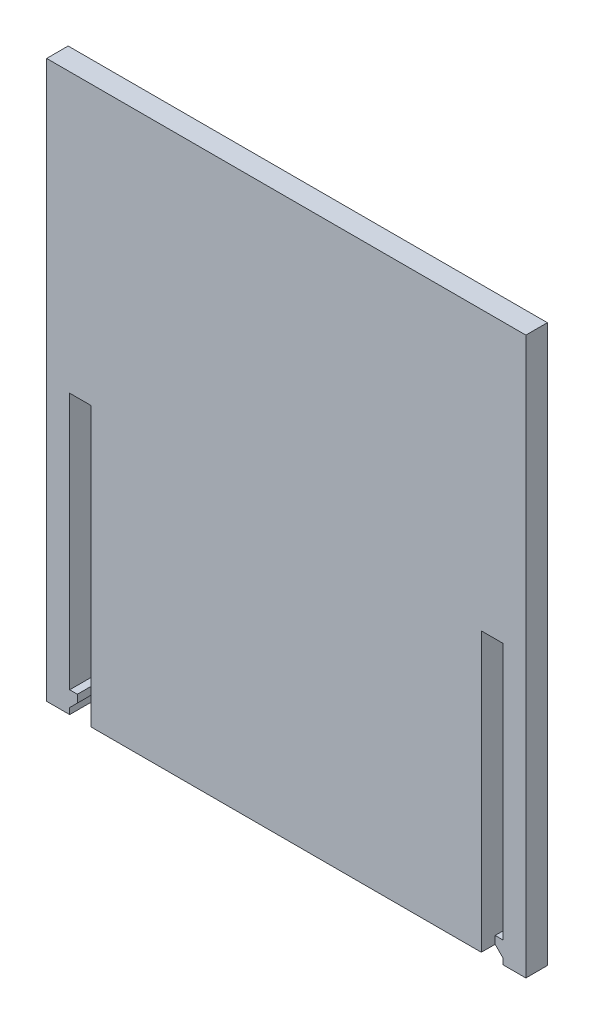
ISO-10303-21;
HEADER;
FILE_DESCRIPTION(('STEP AP214'),'2;1');
FILE_NAME('part.step','',(''),(''),'','','');
FILE_SCHEMA(('AUTOMOTIVE_DESIGN { 1 0 10303 214 1 1 1 1 }'));
ENDSEC;
DATA;
#1=APPLICATION_CONTEXT('core data for automotive mechanical design processes');
#2=APPLICATION_PROTOCOL_DEFINITION('international standard','automotive_design',2000,#1);
#3=PRODUCT_CONTEXT('',#1,'mechanical');
#4=PRODUCT('Part','Part','',(#3));
#5=PRODUCT_RELATED_PRODUCT_CATEGORY('part','',(#4));
#6=PRODUCT_DEFINITION_FORMATION('','',#4);
#7=PRODUCT_DEFINITION_CONTEXT('part definition',#1,'design');
#8=PRODUCT_DEFINITION('design','',#6,#7);
#9=PRODUCT_DEFINITION_SHAPE('','',#8);
#10=(LENGTH_UNIT() NAMED_UNIT(*) SI_UNIT(.MILLI.,.METRE.));
#11=(NAMED_UNIT(*) PLANE_ANGLE_UNIT() SI_UNIT($,.RADIAN.));
#12=(NAMED_UNIT(*) SI_UNIT($,.STERADIAN.) SOLID_ANGLE_UNIT());
#13=UNCERTAINTY_MEASURE_WITH_UNIT(LENGTH_MEASURE(1.E-05),#10,'distance_accuracy_value','');
#14=(GEOMETRIC_REPRESENTATION_CONTEXT(3) GLOBAL_UNCERTAINTY_ASSIGNED_CONTEXT((#13)) GLOBAL_UNIT_ASSIGNED_CONTEXT((#10,
#11,#12)) REPRESENTATION_CONTEXT('',''));
#15=CARTESIAN_POINT('',(0.,0.,0.));
#16=DIRECTION('',(0.,0.,1.));
#17=DIRECTION('',(1.,0.,0.));
#18=AXIS2_PLACEMENT_3D('',#15,#16,#17);
#19=CARTESIAN_POINT('',(0.,0.,2.8));
#20=DIRECTION('',(0.,0.,1.));
#21=DIRECTION('',(1.,0.,0.));
#22=AXIS2_PLACEMENT_3D('',#19,#20,#21);
#23=PLANE('',#22);
#24=DIRECTION('',(1.,0.,0.));
#25=VECTOR('',#24,1.);
#26=CARTESIAN_POINT('',(50.8,-11.0557908114479,2.8));
#27=LINE('',#26,#25);
#28=CARTESIAN_POINT('',(52.6,-11.0557908114479,2.8));
#29=VERTEX_POINT('',#28);
#30=CARTESIAN_POINT('',(53.6,-11.0557908114479,2.8));
#31=VERTEX_POINT('',#30);
#32=EDGE_CURVE('E212',#29,#31,#27,.T.);
#33=ORIENTED_EDGE('',*,*,#32,.F.);
#34=DIRECTION('',(0.,-1.,0.));
#35=VECTOR('',#34,1.);
#36=CARTESIAN_POINT('',(52.6,0.,2.8));
#37=LINE('',#36,#35);
#38=CARTESIAN_POINT('',(52.6,-12.0557908114479,2.8));
#39=VERTEX_POINT('',#38);
#40=EDGE_CURVE('E52',#29,#39,#37,.T.);
#41=ORIENTED_EDGE('',*,*,#40,.T.);
#42=DIRECTION('',(0.707106781186549,-0.707106781186546,0.));
#43=VECTOR('',#42,1.);
#44=CARTESIAN_POINT('',(45.672104594276,-5.12789540572396,2.8));
#45=LINE('',#44,#43);
#46=CARTESIAN_POINT('',(53.6,-13.0557908114479,2.8));
#47=VERTEX_POINT('',#46);
#48=EDGE_CURVE('E191',#39,#47,#45,.T.);
#49=ORIENTED_EDGE('',*,*,#48,.T.);
#50=DIRECTION('',(0.,-1.,0.));
#51=VECTOR('',#50,1.);
#52=CARTESIAN_POINT('',(53.6,0.,2.8));
#53=LINE('',#52,#51);
#54=CARTESIAN_POINT('',(53.6,-13.8557908114479,2.8));
#55=VERTEX_POINT('',#54);
#56=EDGE_CURVE('E360',#47,#55,#53,.T.);
#57=ORIENTED_EDGE('',*,*,#56,.T.);
#58=DIRECTION('',(1.,0.,0.));
#59=VECTOR('',#58,1.);
#60=CARTESIAN_POINT('',(-5.8,-13.8557908114479,2.8));
#61=LINE('',#60,#59);
#62=CARTESIAN_POINT('',(56.6,-13.8557908114479,2.8));
#63=VERTEX_POINT('',#62);
#64=EDGE_CURVE('E227',#55,#63,#61,.T.);
#65=ORIENTED_EDGE('',*,*,#64,.T.);
#66=DIRECTION('',(0.,1.,0.));
#67=VECTOR('',#66,1.);
#68=CARTESIAN_POINT('',(56.6,58.644209188552,2.8));
#69=LINE('',#68,#67);
#70=CARTESIAN_POINT('',(56.6,58.644209188552,2.8));
#71=VERTEX_POINT('',#70);
#72=EDGE_CURVE('E219',#63,#71,#69,.T.);
#73=ORIENTED_EDGE('',*,*,#72,.T.);
#74=DIRECTION('',(-1.,0.,0.));
#75=VECTOR('',#74,1.);
#76=CARTESIAN_POINT('',(-5.80000000000001,58.644209188552,2.8));
#77=LINE('',#76,#75);
#78=CARTESIAN_POINT('',(-5.80000000000001,58.644209188552,2.8));
#79=VERTEX_POINT('',#78);
#80=EDGE_CURVE('E222',#71,#79,#77,.T.);
#81=ORIENTED_EDGE('',*,*,#80,.T.);
#82=DIRECTION('',(0.,-1.,0.));
#83=VECTOR('',#82,1.);
#84=CARTESIAN_POINT('',(-5.80000000000001,58.644209188552,2.8));
#85=LINE('',#84,#83);
#86=CARTESIAN_POINT('',(-5.8,-13.8557908114479,2.8));
#87=VERTEX_POINT('',#86);
#88=EDGE_CURVE('E225',#79,#87,#85,.T.);
#89=ORIENTED_EDGE('',*,*,#88,.T.);
#90=CARTESIAN_POINT('',(-2.8,-13.8557908114479,2.8));
#91=VERTEX_POINT('',#90);
#92=EDGE_CURVE('E228',#87,#91,#61,.T.);
#93=ORIENTED_EDGE('',*,*,#92,.T.);
#94=DIRECTION('',(0.,-1.,0.));
#95=VECTOR('',#94,1.);
#96=CARTESIAN_POINT('',(-2.8,0.,2.8));
#97=LINE('',#96,#95);
#98=CARTESIAN_POINT('',(-2.8,-13.0557908114479,2.8));
#99=VERTEX_POINT('',#98);
#100=EDGE_CURVE('E269',#99,#91,#97,.T.);
#101=ORIENTED_EDGE('',*,*,#100,.F.);
#102=DIRECTION('',(-0.707106781186548,-0.707106781186547,0.));
#103=VECTOR('',#102,1.);
#104=CARTESIAN_POINT('',(5.12789540572396,-5.12789540572397,2.8));
#105=LINE('',#104,#103);
#106=CARTESIAN_POINT('',(-1.8,-12.0557908114479,2.8));
#107=VERTEX_POINT('',#106);
#108=EDGE_CURVE('E311',#107,#99,#105,.T.);
#109=ORIENTED_EDGE('',*,*,#108,.F.);
#110=DIRECTION('',(0.,-1.,0.));
#111=VECTOR('',#110,1.);
#112=CARTESIAN_POINT('',(-1.8,0.,2.8));
#113=LINE('',#112,#111);
#114=CARTESIAN_POINT('',(-1.8,-11.0557908114479,2.8));
#115=VERTEX_POINT('',#114);
#116=EDGE_CURVE('E308',#115,#107,#113,.T.);
#117=ORIENTED_EDGE('',*,*,#116,.F.);
#118=DIRECTION('',(1.,0.,0.));
#119=VECTOR('',#118,1.);
#120=CARTESIAN_POINT('',(-2.8,-11.0557908114479,2.8));
#121=LINE('',#120,#119);
#122=CARTESIAN_POINT('',(-2.8,-11.0557908114479,2.8));
#123=VERTEX_POINT('',#122);
#124=EDGE_CURVE('E324',#123,#115,#121,.T.);
#125=ORIENTED_EDGE('',*,*,#124,.F.);
#126=DIRECTION('',(0.,-1.,0.));
#127=VECTOR('',#126,1.);
#128=CARTESIAN_POINT('',(-2.8,22.3942091885521,2.8));
#129=LINE('',#128,#127);
#130=CARTESIAN_POINT('',(-2.8,22.3942091885521,2.8));
#131=VERTEX_POINT('',#130);
#132=EDGE_CURVE('E333',#131,#123,#129,.T.);
#133=ORIENTED_EDGE('',*,*,#132,.F.);
#134=DIRECTION('',(-1.,0.,0.));
#135=VECTOR('',#134,1.);
#136=CARTESIAN_POINT('',(-2.8,22.3942091885521,2.8));
#137=LINE('',#136,#135);
#138=CARTESIAN_POINT('',(0.,22.3942091885521,2.8));
#139=VERTEX_POINT('',#138);
#140=EDGE_CURVE('E330',#139,#131,#137,.T.);
#141=ORIENTED_EDGE('',*,*,#140,.F.);
#142=DIRECTION('',(0.,1.,0.));
#143=VECTOR('',#142,1.);
#144=CARTESIAN_POINT('',(0.,22.3942091885521,2.8));
#145=LINE('',#144,#143);
#146=CARTESIAN_POINT('',(0.,-13.8557908114479,2.8));
#147=VERTEX_POINT('',#146);
#148=EDGE_CURVE('E327',#147,#139,#145,.T.);
#149=ORIENTED_EDGE('',*,*,#148,.F.);
#150=CARTESIAN_POINT('',(50.8,-13.8557908114479,2.8));
#151=VERTEX_POINT('',#150);
#152=EDGE_CURVE('E232',#147,#151,#61,.T.);
#153=ORIENTED_EDGE('',*,*,#152,.T.);
#154=DIRECTION('',(0.,-1.,0.));
#155=VECTOR('',#154,1.);
#156=CARTESIAN_POINT('',(50.8,22.3942091885521,2.8));
#157=LINE('',#156,#155);
#158=CARTESIAN_POINT('',(50.8,22.3942091885521,2.8));
#159=VERTEX_POINT('',#158);
#160=EDGE_CURVE('E205',#159,#151,#157,.T.);
#161=ORIENTED_EDGE('',*,*,#160,.F.);
#162=DIRECTION('',(-1.,0.,0.));
#163=VECTOR('',#162,1.);
#164=CARTESIAN_POINT('',(50.8,22.3942091885521,2.8));
#165=LINE('',#164,#163);
#166=CARTESIAN_POINT('',(53.6,22.3942091885521,2.8));
#167=VERTEX_POINT('',#166);
#168=EDGE_CURVE('E348',#167,#159,#165,.T.);
#169=ORIENTED_EDGE('',*,*,#168,.F.);
#170=DIRECTION('',(0.,1.,0.));
#171=VECTOR('',#170,1.);
#172=CARTESIAN_POINT('',(53.6,22.3942091885521,2.8));
#173=LINE('',#172,#171);
#174=EDGE_CURVE('E347',#31,#167,#173,.T.);
#175=ORIENTED_EDGE('',*,*,#174,.F.);
#176=EDGE_LOOP('',(#33,#41,#49,#57,#65,#73,#81,#89,#93,#101,#109,#117,#125,#133,#141,#149,#153,
#161,#169,#175));
#177=FACE_BOUND('',#176,.T.);
#178=ADVANCED_FACE('F37',(#177),#23,.T.);
#179=CARTESIAN_POINT('',(0.,0.,0.));
#180=DIRECTION('',(0.,0.,1.));
#181=DIRECTION('',(1.,0.,0.));
#182=AXIS2_PLACEMENT_3D('',#179,#180,#181);
#183=PLANE('',#182);
#184=DIRECTION('',(0.,-1.,0.));
#185=VECTOR('',#184,1.);
#186=CARTESIAN_POINT('',(52.6,0.,0.));
#187=LINE('',#186,#185);
#188=CARTESIAN_POINT('',(52.6,-11.0557908114479,0.));
#189=VERTEX_POINT('',#188);
#190=CARTESIAN_POINT('',(52.6,-12.0557908114479,0.));
#191=VERTEX_POINT('',#190);
#192=EDGE_CURVE('E175',#189,#191,#187,.T.);
#193=ORIENTED_EDGE('',*,*,#192,.F.);
#194=DIRECTION('',(1.,0.,0.));
#195=VECTOR('',#194,1.);
#196=CARTESIAN_POINT('',(50.8,-11.0557908114479,0.));
#197=LINE('',#196,#195);
#198=CARTESIAN_POINT('',(53.6,-11.0557908114479,0.));
#199=VERTEX_POINT('',#198);
#200=EDGE_CURVE('E187',#189,#199,#197,.T.);
#201=ORIENTED_EDGE('',*,*,#200,.T.);
#202=DIRECTION('',(0.,1.,0.));
#203=VECTOR('',#202,1.);
#204=CARTESIAN_POINT('',(53.6,22.3942091885521,0.));
#205=LINE('',#204,#203);
#206=CARTESIAN_POINT('',(53.6,22.3942091885521,0.));
#207=VERTEX_POINT('',#206);
#208=EDGE_CURVE('E197',#199,#207,#205,.T.);
#209=ORIENTED_EDGE('',*,*,#208,.T.);
#210=DIRECTION('',(-1.,0.,0.));
#211=VECTOR('',#210,1.);
#212=CARTESIAN_POINT('',(50.8,22.3942091885521,0.));
#213=LINE('',#212,#211);
#214=CARTESIAN_POINT('',(50.8,22.3942091885521,0.));
#215=VERTEX_POINT('',#214);
#216=EDGE_CURVE('E200',#207,#215,#213,.T.);
#217=ORIENTED_EDGE('',*,*,#216,.T.);
#218=DIRECTION('',(0.,-1.,0.));
#219=VECTOR('',#218,1.);
#220=CARTESIAN_POINT('',(50.8,22.3942091885521,0.));
#221=LINE('',#220,#219);
#222=CARTESIAN_POINT('',(50.8,-13.8557908114479,0.));
#223=VERTEX_POINT('',#222);
#224=EDGE_CURVE('E210',#215,#223,#221,.T.);
#225=ORIENTED_EDGE('',*,*,#224,.T.);
#226=DIRECTION('',(1.,0.,0.));
#227=VECTOR('',#226,1.);
#228=CARTESIAN_POINT('',(-5.8,-13.8557908114479,0.));
#229=LINE('',#228,#227);
#230=CARTESIAN_POINT('',(0.,-13.8557908114479,0.));
#231=VERTEX_POINT('',#230);
#232=EDGE_CURVE('E242',#231,#223,#229,.T.);
#233=ORIENTED_EDGE('',*,*,#232,.F.);
#234=DIRECTION('',(0.,1.,0.));
#235=VECTOR('',#234,1.);
#236=CARTESIAN_POINT('',(0.,22.3942091885521,0.));
#237=LINE('',#236,#235);
#238=CARTESIAN_POINT('',(0.,22.3942091885521,0.));
#239=VERTEX_POINT('',#238);
#240=EDGE_CURVE('E291',#231,#239,#237,.T.);
#241=ORIENTED_EDGE('',*,*,#240,.T.);
#242=DIRECTION('',(-1.,0.,0.));
#243=VECTOR('',#242,1.);
#244=CARTESIAN_POINT('',(-2.8,22.3942091885521,0.));
#245=LINE('',#244,#243);
#246=CARTESIAN_POINT('',(-2.8,22.3942091885521,0.));
#247=VERTEX_POINT('',#246);
#248=EDGE_CURVE('E339',#239,#247,#245,.T.);
#249=ORIENTED_EDGE('',*,*,#248,.T.);
#250=DIRECTION('',(0.,-1.,0.));
#251=VECTOR('',#250,1.);
#252=CARTESIAN_POINT('',(-2.8,22.3942091885521,0.));
#253=LINE('',#252,#251);
#254=CARTESIAN_POINT('',(-2.8,-11.0557908114479,0.));
#255=VERTEX_POINT('',#254);
#256=EDGE_CURVE('E328',#247,#255,#253,.T.);
#257=ORIENTED_EDGE('',*,*,#256,.T.);
#258=DIRECTION('',(1.,0.,0.));
#259=VECTOR('',#258,1.);
#260=CARTESIAN_POINT('',(-2.8,-11.0557908114479,0.));
#261=LINE('',#260,#259);
#262=CARTESIAN_POINT('',(-1.8,-11.0557908114479,0.));
#263=VERTEX_POINT('',#262);
#264=EDGE_CURVE('E318',#255,#263,#261,.T.);
#265=ORIENTED_EDGE('',*,*,#264,.T.);
#266=DIRECTION('',(0.,-1.,0.));
#267=VECTOR('',#266,1.);
#268=CARTESIAN_POINT('',(-1.8,0.,0.));
#269=LINE('',#268,#267);
#270=CARTESIAN_POINT('',(-1.8,-12.0557908114479,0.));
#271=VERTEX_POINT('',#270);
#272=EDGE_CURVE('E60',#263,#271,#269,.T.);
#273=ORIENTED_EDGE('',*,*,#272,.T.);
#274=DIRECTION('',(-0.707106781186548,-0.707106781186547,0.));
#275=VECTOR('',#274,1.);
#276=CARTESIAN_POINT('',(5.12789540572396,-5.12789540572397,0.));
#277=LINE('',#276,#275);
#278=CARTESIAN_POINT('',(-2.8,-13.0557908114479,0.));
#279=VERTEX_POINT('',#278);
#280=EDGE_CURVE('E304',#271,#279,#277,.T.);
#281=ORIENTED_EDGE('',*,*,#280,.T.);
#282=DIRECTION('',(0.,-1.,0.));
#283=VECTOR('',#282,1.);
#284=CARTESIAN_POINT('',(-2.8,0.,0.));
#285=LINE('',#284,#283);
#286=CARTESIAN_POINT('',(-2.8,-13.8557908114479,0.));
#287=VERTEX_POINT('',#286);
#288=EDGE_CURVE('E260',#279,#287,#285,.T.);
#289=ORIENTED_EDGE('',*,*,#288,.T.);
#290=CARTESIAN_POINT('',(-5.8,-13.8557908114479,0.));
#291=VERTEX_POINT('',#290);
#292=EDGE_CURVE('E223',#291,#287,#229,.T.);
#293=ORIENTED_EDGE('',*,*,#292,.F.);
#294=DIRECTION('',(0.,-1.,0.));
#295=VECTOR('',#294,1.);
#296=CARTESIAN_POINT('',(-5.80000000000001,58.644209188552,0.));
#297=LINE('',#296,#295);
#298=CARTESIAN_POINT('',(-5.80000000000001,58.644209188552,0.));
#299=VERTEX_POINT('',#298);
#300=EDGE_CURVE('E237',#299,#291,#297,.T.);
#301=ORIENTED_EDGE('',*,*,#300,.F.);
#302=DIRECTION('',(-1.,0.,0.));
#303=VECTOR('',#302,1.);
#304=CARTESIAN_POINT('',(-5.80000000000001,58.644209188552,0.));
#305=LINE('',#304,#303);
#306=CARTESIAN_POINT('',(56.6,58.644209188552,0.));
#307=VERTEX_POINT('',#306);
#308=EDGE_CURVE('E235',#307,#299,#305,.T.);
#309=ORIENTED_EDGE('',*,*,#308,.F.);
#310=DIRECTION('',(0.,1.,0.));
#311=VECTOR('',#310,1.);
#312=CARTESIAN_POINT('',(56.6,58.644209188552,0.));
#313=LINE('',#312,#311);
#314=CARTESIAN_POINT('',(56.6,-13.8557908114479,0.));
#315=VERTEX_POINT('',#314);
#316=EDGE_CURVE('E218',#315,#307,#313,.T.);
#317=ORIENTED_EDGE('',*,*,#316,.F.);
#318=CARTESIAN_POINT('',(53.6,-13.8557908114479,0.));
#319=VERTEX_POINT('',#318);
#320=EDGE_CURVE('E239',#319,#315,#229,.T.);
#321=ORIENTED_EDGE('',*,*,#320,.F.);
#322=DIRECTION('',(0.,-1.,0.));
#323=VECTOR('',#322,1.);
#324=CARTESIAN_POINT('',(53.6,0.,0.));
#325=LINE('',#324,#323);
#326=CARTESIAN_POINT('',(53.6,-13.0557908114479,0.));
#327=VERTEX_POINT('',#326);
#328=EDGE_CURVE('E190',#327,#319,#325,.T.);
#329=ORIENTED_EDGE('',*,*,#328,.F.);
#330=DIRECTION('',(0.707106781186549,-0.707106781186546,0.));
#331=VECTOR('',#330,1.);
#332=CARTESIAN_POINT('',(45.672104594276,-5.12789540572396,0.));
#333=LINE('',#332,#331);
#334=EDGE_CURVE('E181',#191,#327,#333,.T.);
#335=ORIENTED_EDGE('',*,*,#334,.F.);
#336=EDGE_LOOP('',(#193,#201,#209,#217,#225,#233,#241,#249,#257,#265,#273,#281,#289,#293,#301,
#309,#317,#321,#329,#335));
#337=FACE_BOUND('',#336,.T.);
#338=ADVANCED_FACE('F185',(#337),#183,.F.);
#339=CARTESIAN_POINT('',(-5.8,-13.8557908114479,2.8));
#340=DIRECTION('',(0.,1.,0.));
#341=DIRECTION('',(0.,0.,1.));
#342=AXIS2_PLACEMENT_3D('',#339,#340,#341);
#343=PLANE('',#342);
#344=DIRECTION('',(0.,0.,1.));
#345=VECTOR('',#344,1.);
#346=CARTESIAN_POINT('',(53.6,-13.8557908114479,0.));
#347=LINE('',#346,#345);
#348=EDGE_CURVE('E297',#319,#55,#347,.T.);
#349=ORIENTED_EDGE('',*,*,#348,.F.);
#350=ORIENTED_EDGE('',*,*,#320,.T.);
#351=DIRECTION('',(0.,0.,-1.));
#352=VECTOR('',#351,1.);
#353=CARTESIAN_POINT('',(56.6,-13.8557908114479,2.8));
#354=LINE('',#353,#352);
#355=EDGE_CURVE('E231',#63,#315,#354,.T.);
#356=ORIENTED_EDGE('',*,*,#355,.F.);
#357=ORIENTED_EDGE('',*,*,#64,.F.);
#358=EDGE_LOOP('',(#349,#350,#356,#357));
#359=FACE_BOUND('',#358,.T.);
#360=ADVANCED_FACE('F361',(#359),#343,.F.);
#361=CARTESIAN_POINT('',(50.8,-11.0557908114479,2.8));
#362=DIRECTION('',(0.,1.,0.));
#363=DIRECTION('',(-1.,0.,0.));
#364=AXIS2_PLACEMENT_3D('',#361,#362,#363);
#365=PLANE('',#364);
#366=ORIENTED_EDGE('',*,*,#200,.F.);
#367=DIRECTION('',(0.,0.,1.));
#368=VECTOR('',#367,1.);
#369=CARTESIAN_POINT('',(52.6,-11.0557908114479,0.));
#370=LINE('',#369,#368);
#371=EDGE_CURVE('E172',#189,#29,#370,.T.);
#372=ORIENTED_EDGE('',*,*,#371,.T.);
#373=ORIENTED_EDGE('',*,*,#32,.T.);
#374=DIRECTION('',(0.,0.,-1.));
#375=VECTOR('',#374,1.);
#376=CARTESIAN_POINT('',(53.6,-11.0557908114479,2.8));
#377=LINE('',#376,#375);
#378=EDGE_CURVE('E196',#31,#199,#377,.T.);
#379=ORIENTED_EDGE('',*,*,#378,.T.);
#380=EDGE_LOOP('',(#366,#372,#373,#379));
#381=FACE_BOUND('',#380,.T.);
#382=ADVANCED_FACE('F194',(#381),#365,.T.);
#383=ORIENTED_EDGE('',*,*,#232,.T.);
#384=DIRECTION('',(0.,0.,1.));
#385=VECTOR('',#384,1.);
#386=CARTESIAN_POINT('',(50.8,-13.8557908114479,0.));
#387=LINE('',#386,#385);
#388=EDGE_CURVE('E180',#223,#151,#387,.T.);
#389=ORIENTED_EDGE('',*,*,#388,.T.);
#390=ORIENTED_EDGE('',*,*,#152,.F.);
#391=DIRECTION('',(0.,0.,1.));
#392=VECTOR('',#391,1.);
#393=CARTESIAN_POINT('',(0.,-13.8557908114479,0.));
#394=LINE('',#393,#392);
#395=EDGE_CURVE('E288',#231,#147,#394,.T.);
#396=ORIENTED_EDGE('',*,*,#395,.F.);
#397=EDGE_LOOP('',(#383,#389,#390,#396));
#398=FACE_BOUND('',#397,.T.);
#399=ADVANCED_FACE('F283',(#398),#343,.F.);
#400=CARTESIAN_POINT('',(56.6,58.644209188552,2.8));
#401=DIRECTION('',(-1.,0.,0.));
#402=DIRECTION('',(0.,-1.,0.));
#403=AXIS2_PLACEMENT_3D('',#400,#401,#402);
#404=PLANE('',#403);
#405=ORIENTED_EDGE('',*,*,#316,.T.);
#406=DIRECTION('',(0.,0.,-1.));
#407=VECTOR('',#406,1.);
#408=CARTESIAN_POINT('',(56.6,58.644209188552,2.8));
#409=LINE('',#408,#407);
#410=EDGE_CURVE('E11',#71,#307,#409,.T.);
#411=ORIENTED_EDGE('',*,*,#410,.F.);
#412=ORIENTED_EDGE('',*,*,#72,.F.);
#413=ORIENTED_EDGE('',*,*,#355,.T.);
#414=EDGE_LOOP('',(#405,#411,#412,#413));
#415=FACE_BOUND('',#414,.T.);
#416=ADVANCED_FACE('F39',(#415),#404,.F.);
#417=CARTESIAN_POINT('',(-5.80000000000001,58.644209188552,2.8));
#418=DIRECTION('',(0.,-1.,0.));
#419=DIRECTION('',(0.,0.,-1.));
#420=AXIS2_PLACEMENT_3D('',#417,#418,#419);
#421=PLANE('',#420);
#422=ORIENTED_EDGE('',*,*,#308,.T.);
#423=DIRECTION('',(0.,0.,-1.));
#424=VECTOR('',#423,1.);
#425=CARTESIAN_POINT('',(-5.80000000000001,58.644209188552,2.8));
#426=LINE('',#425,#424);
#427=EDGE_CURVE('E45',#79,#299,#426,.T.);
#428=ORIENTED_EDGE('',*,*,#427,.F.);
#429=ORIENTED_EDGE('',*,*,#80,.F.);
#430=ORIENTED_EDGE('',*,*,#410,.T.);
#431=EDGE_LOOP('',(#422,#428,#429,#430));
#432=FACE_BOUND('',#431,.T.);
#433=ADVANCED_FACE('F272',(#432),#421,.F.);
#434=CARTESIAN_POINT('',(-5.80000000000001,58.644209188552,2.8));
#435=DIRECTION('',(1.,0.,0.));
#436=DIRECTION('',(0.,1.,0.));
#437=AXIS2_PLACEMENT_3D('',#434,#435,#436);
#438=PLANE('',#437);
#439=ORIENTED_EDGE('',*,*,#300,.T.);
#440=DIRECTION('',(0.,0.,-1.));
#441=VECTOR('',#440,1.);
#442=CARTESIAN_POINT('',(-5.8,-13.8557908114479,2.8));
#443=LINE('',#442,#441);
#444=EDGE_CURVE('E245',#87,#291,#443,.T.);
#445=ORIENTED_EDGE('',*,*,#444,.F.);
#446=ORIENTED_EDGE('',*,*,#88,.F.);
#447=ORIENTED_EDGE('',*,*,#427,.T.);
#448=EDGE_LOOP('',(#439,#445,#446,#447));
#449=FACE_BOUND('',#448,.T.);
#450=ADVANCED_FACE('F252',(#449),#438,.F.);
#451=ORIENTED_EDGE('',*,*,#292,.T.);
#452=DIRECTION('',(0.,0.,1.));
#453=VECTOR('',#452,1.);
#454=CARTESIAN_POINT('',(-2.8,-13.8557908114479,0.));
#455=LINE('',#454,#453);
#456=EDGE_CURVE('E265',#287,#91,#455,.T.);
#457=ORIENTED_EDGE('',*,*,#456,.T.);
#458=ORIENTED_EDGE('',*,*,#92,.F.);
#459=ORIENTED_EDGE('',*,*,#444,.T.);
#460=EDGE_LOOP('',(#451,#457,#458,#459));
#461=FACE_BOUND('',#460,.T.);
#462=ADVANCED_FACE('F263',(#461),#343,.F.);
#463=CARTESIAN_POINT('',(53.6,22.3942091885521,2.8));
#464=DIRECTION('',(-1.,0.,0.));
#465=DIRECTION('',(0.,0.,1.));
#466=AXIS2_PLACEMENT_3D('',#463,#464,#465);
#467=PLANE('',#466);
#468=ORIENTED_EDGE('',*,*,#208,.F.);
#469=ORIENTED_EDGE('',*,*,#378,.F.);
#470=ORIENTED_EDGE('',*,*,#174,.T.);
#471=DIRECTION('',(0.,0.,-1.));
#472=VECTOR('',#471,1.);
#473=CARTESIAN_POINT('',(53.6,22.3942091885521,2.8));
#474=LINE('',#473,#472);
#475=EDGE_CURVE('E215',#167,#207,#474,.T.);
#476=ORIENTED_EDGE('',*,*,#475,.T.);
#477=EDGE_LOOP('',(#468,#469,#470,#476));
#478=FACE_BOUND('',#477,.T.);
#479=ADVANCED_FACE('F373',(#478),#467,.T.);
#480=CARTESIAN_POINT('',(50.8,22.3942091885521,2.8));
#481=DIRECTION('',(0.,-1.,0.));
#482=DIRECTION('',(0.,0.,-1.));
#483=AXIS2_PLACEMENT_3D('',#480,#481,#482);
#484=PLANE('',#483);
#485=ORIENTED_EDGE('',*,*,#216,.F.);
#486=ORIENTED_EDGE('',*,*,#475,.F.);
#487=ORIENTED_EDGE('',*,*,#168,.T.);
#488=DIRECTION('',(0.,0.,-1.));
#489=VECTOR('',#488,1.);
#490=CARTESIAN_POINT('',(50.8,22.3942091885521,2.8));
#491=LINE('',#490,#489);
#492=EDGE_CURVE('E213',#159,#215,#491,.T.);
#493=ORIENTED_EDGE('',*,*,#492,.T.);
#494=EDGE_LOOP('',(#485,#486,#487,#493));
#495=FACE_BOUND('',#494,.T.);
#496=ADVANCED_FACE('F353',(#495),#484,.T.);
#497=CARTESIAN_POINT('',(50.8,22.3942091885521,2.8));
#498=DIRECTION('',(1.,0.,0.));
#499=DIRECTION('',(0.,0.,-1.));
#500=AXIS2_PLACEMENT_3D('',#497,#498,#499);
#501=PLANE('',#500);
#502=ORIENTED_EDGE('',*,*,#224,.F.);
#503=ORIENTED_EDGE('',*,*,#492,.F.);
#504=ORIENTED_EDGE('',*,*,#160,.T.);
#505=ORIENTED_EDGE('',*,*,#388,.F.);
#506=EDGE_LOOP('',(#502,#503,#504,#505));
#507=FACE_BOUND('',#506,.T.);
#508=ADVANCED_FACE('F295',(#507),#501,.T.);
#509=CARTESIAN_POINT('',(-2.8,-11.0557908114479,2.8));
#510=DIRECTION('',(0.,1.,0.));
#511=DIRECTION('',(-1.,0.,0.));
#512=AXIS2_PLACEMENT_3D('',#509,#510,#511);
#513=PLANE('',#512);
#514=DIRECTION('',(0.,0.,1.));
#515=VECTOR('',#514,1.);
#516=CARTESIAN_POINT('',(-1.8,-11.0557908114479,0.));
#517=LINE('',#516,#515);
#518=EDGE_CURVE('E316',#263,#115,#517,.T.);
#519=ORIENTED_EDGE('',*,*,#518,.F.);
#520=ORIENTED_EDGE('',*,*,#264,.F.);
#521=DIRECTION('',(0.,0.,-1.));
#522=VECTOR('',#521,1.);
#523=CARTESIAN_POINT('',(-2.8,-11.0557908114479,2.8));
#524=LINE('',#523,#522);
#525=EDGE_CURVE('E335',#123,#255,#524,.T.);
#526=ORIENTED_EDGE('',*,*,#525,.F.);
#527=ORIENTED_EDGE('',*,*,#124,.T.);
#528=EDGE_LOOP('',(#519,#520,#526,#527));
#529=FACE_BOUND('',#528,.T.);
#530=ADVANCED_FACE('F386',(#529),#513,.T.);
#531=CARTESIAN_POINT('',(0.,22.3942091885521,2.8));
#532=DIRECTION('',(-1.,0.,0.));
#533=DIRECTION('',(0.,0.,1.));
#534=AXIS2_PLACEMENT_3D('',#531,#532,#533);
#535=PLANE('',#534);
#536=ORIENTED_EDGE('',*,*,#240,.F.);
#537=ORIENTED_EDGE('',*,*,#395,.T.);
#538=ORIENTED_EDGE('',*,*,#148,.T.);
#539=DIRECTION('',(0.,0.,-1.));
#540=VECTOR('',#539,1.);
#541=CARTESIAN_POINT('',(0.,22.3942091885521,2.8));
#542=LINE('',#541,#540);
#543=EDGE_CURVE('E198',#139,#239,#542,.T.);
#544=ORIENTED_EDGE('',*,*,#543,.T.);
#545=EDGE_LOOP('',(#536,#537,#538,#544));
#546=FACE_BOUND('',#545,.T.);
#547=ADVANCED_FACE('F389',(#546),#535,.T.);
#548=CARTESIAN_POINT('',(-2.8,22.3942091885521,2.8));
#549=DIRECTION('',(0.,-1.,0.));
#550=DIRECTION('',(1.,0.,0.));
#551=AXIS2_PLACEMENT_3D('',#548,#549,#550);
#552=PLANE('',#551);
#553=ORIENTED_EDGE('',*,*,#248,.F.);
#554=ORIENTED_EDGE('',*,*,#543,.F.);
#555=ORIENTED_EDGE('',*,*,#140,.T.);
#556=DIRECTION('',(0.,0.,-1.));
#557=VECTOR('',#556,1.);
#558=CARTESIAN_POINT('',(-2.8,22.3942091885521,2.8));
#559=LINE('',#558,#557);
#560=EDGE_CURVE('E202',#131,#247,#559,.T.);
#561=ORIENTED_EDGE('',*,*,#560,.T.);
#562=EDGE_LOOP('',(#553,#554,#555,#561));
#563=FACE_BOUND('',#562,.T.);
#564=ADVANCED_FACE('F393',(#563),#552,.T.);
#565=CARTESIAN_POINT('',(-2.8,22.3942091885521,2.8));
#566=DIRECTION('',(1.,0.,0.));
#567=DIRECTION('',(0.,0.,-1.));
#568=AXIS2_PLACEMENT_3D('',#565,#566,#567);
#569=PLANE('',#568);
#570=ORIENTED_EDGE('',*,*,#256,.F.);
#571=ORIENTED_EDGE('',*,*,#560,.F.);
#572=ORIENTED_EDGE('',*,*,#132,.T.);
#573=ORIENTED_EDGE('',*,*,#525,.T.);
#574=EDGE_LOOP('',(#570,#571,#572,#573));
#575=FACE_BOUND('',#574,.T.);
#576=ADVANCED_FACE('F397',(#575),#569,.T.);
#577=CARTESIAN_POINT('',(-1.8,0.,0.));
#578=DIRECTION('',(-1.,0.,0.));
#579=DIRECTION('',(0.,0.,1.));
#580=AXIS2_PLACEMENT_3D('',#577,#578,#579);
#581=PLANE('',#580);
#582=ORIENTED_EDGE('',*,*,#116,.T.);
#583=DIRECTION('',(0.,0.,1.));
#584=VECTOR('',#583,1.);
#585=CARTESIAN_POINT('',(-1.8,-12.0557908114479,0.));
#586=LINE('',#585,#584);
#587=EDGE_CURVE('E307',#271,#107,#586,.T.);
#588=ORIENTED_EDGE('',*,*,#587,.F.);
#589=ORIENTED_EDGE('',*,*,#272,.F.);
#590=ORIENTED_EDGE('',*,*,#518,.T.);
#591=EDGE_LOOP('',(#582,#588,#589,#590));
#592=FACE_BOUND('',#591,.T.);
#593=ADVANCED_FACE('F401',(#592),#581,.F.);
#594=CARTESIAN_POINT('',(-2.8,0.,0.));
#595=DIRECTION('',(-1.,0.,0.));
#596=DIRECTION('',(0.,-1.,0.));
#597=AXIS2_PLACEMENT_3D('',#594,#595,#596);
#598=PLANE('',#597);
#599=ORIENTED_EDGE('',*,*,#100,.T.);
#600=ORIENTED_EDGE('',*,*,#456,.F.);
#601=ORIENTED_EDGE('',*,*,#288,.F.);
#602=DIRECTION('',(0.,0.,1.));
#603=VECTOR('',#602,1.);
#604=CARTESIAN_POINT('',(-2.8,-13.0557908114479,0.));
#605=LINE('',#604,#603);
#606=EDGE_CURVE('E321',#279,#99,#605,.T.);
#607=ORIENTED_EDGE('',*,*,#606,.T.);
#608=EDGE_LOOP('',(#599,#600,#601,#607));
#609=FACE_BOUND('',#608,.T.);
#610=ADVANCED_FACE('F405',(#609),#598,.F.);
#611=CARTESIAN_POINT('',(5.12789540572396,-5.12789540572397,0.));
#612=DIRECTION('',(-0.707106781186547,0.707106781186548,0.));
#613=DIRECTION('',(-0.707106781186548,-0.707106781186547,0.));
#614=AXIS2_PLACEMENT_3D('',#611,#612,#613);
#615=PLANE('',#614);
#616=ORIENTED_EDGE('',*,*,#108,.T.);
#617=ORIENTED_EDGE('',*,*,#606,.F.);
#618=ORIENTED_EDGE('',*,*,#280,.F.);
#619=ORIENTED_EDGE('',*,*,#587,.T.);
#620=EDGE_LOOP('',(#616,#617,#618,#619));
#621=FACE_BOUND('',#620,.T.);
#622=ADVANCED_FACE('F406',(#621),#615,.F.);
#623=CARTESIAN_POINT('',(52.6,0.,0.));
#624=DIRECTION('',(-1.,0.,0.));
#625=DIRECTION('',(0.,-1.,0.));
#626=AXIS2_PLACEMENT_3D('',#623,#624,#625);
#627=PLANE('',#626);
#628=ORIENTED_EDGE('',*,*,#40,.F.);
#629=ORIENTED_EDGE('',*,*,#371,.F.);
#630=ORIENTED_EDGE('',*,*,#192,.T.);
#631=DIRECTION('',(0.,0.,1.));
#632=VECTOR('',#631,1.);
#633=CARTESIAN_POINT('',(52.6,-12.0557908114479,0.));
#634=LINE('',#633,#632);
#635=EDGE_CURVE('E312',#191,#39,#634,.T.);
#636=ORIENTED_EDGE('',*,*,#635,.T.);
#637=EDGE_LOOP('',(#628,#629,#630,#636));
#638=FACE_BOUND('',#637,.T.);
#639=ADVANCED_FACE('F174',(#638),#627,.T.);
#640=CARTESIAN_POINT('',(45.672104594276,-5.12789540572396,0.));
#641=DIRECTION('',(-0.707106781186546,-0.707106781186549,0.));
#642=DIRECTION('',(0.707106781186549,-0.707106781186546,0.));
#643=AXIS2_PLACEMENT_3D('',#640,#641,#642);
#644=PLANE('',#643);
#645=ORIENTED_EDGE('',*,*,#48,.F.);
#646=ORIENTED_EDGE('',*,*,#635,.F.);
#647=ORIENTED_EDGE('',*,*,#334,.T.);
#648=DIRECTION('',(0.,0.,1.));
#649=VECTOR('',#648,1.);
#650=CARTESIAN_POINT('',(53.6,-13.0557908114479,0.));
#651=LINE('',#650,#649);
#652=EDGE_CURVE('E299',#327,#47,#651,.T.);
#653=ORIENTED_EDGE('',*,*,#652,.T.);
#654=EDGE_LOOP('',(#645,#646,#647,#653));
#655=FACE_BOUND('',#654,.T.);
#656=ADVANCED_FACE('F415',(#655),#644,.T.);
#657=CARTESIAN_POINT('',(53.6,0.,0.));
#658=DIRECTION('',(-1.,0.,0.));
#659=DIRECTION('',(0.,-1.,0.));
#660=AXIS2_PLACEMENT_3D('',#657,#658,#659);
#661=PLANE('',#660);
#662=ORIENTED_EDGE('',*,*,#56,.F.);
#663=ORIENTED_EDGE('',*,*,#652,.F.);
#664=ORIENTED_EDGE('',*,*,#328,.T.);
#665=ORIENTED_EDGE('',*,*,#348,.T.);
#666=EDGE_LOOP('',(#662,#663,#664,#665));
#667=FACE_BOUND('',#666,.T.);
#668=ADVANCED_FACE('F416',(#667),#661,.T.);
#669=CLOSED_SHELL('',(#178,#338,#360,#382,#399,#416,#433,#450,#462,#479,#496,#508,#530,#547,
#564,#576,#593,#610,#622,#639,#656,#668));
#670=MANIFOLD_SOLID_BREP('B2',#669);
#671=ADVANCED_BREP_SHAPE_REPRESENTATION('',(#18,#670),#14);
#672=SHAPE_DEFINITION_REPRESENTATION(#9,#671);
ENDSEC;
END-ISO-10303-21;
